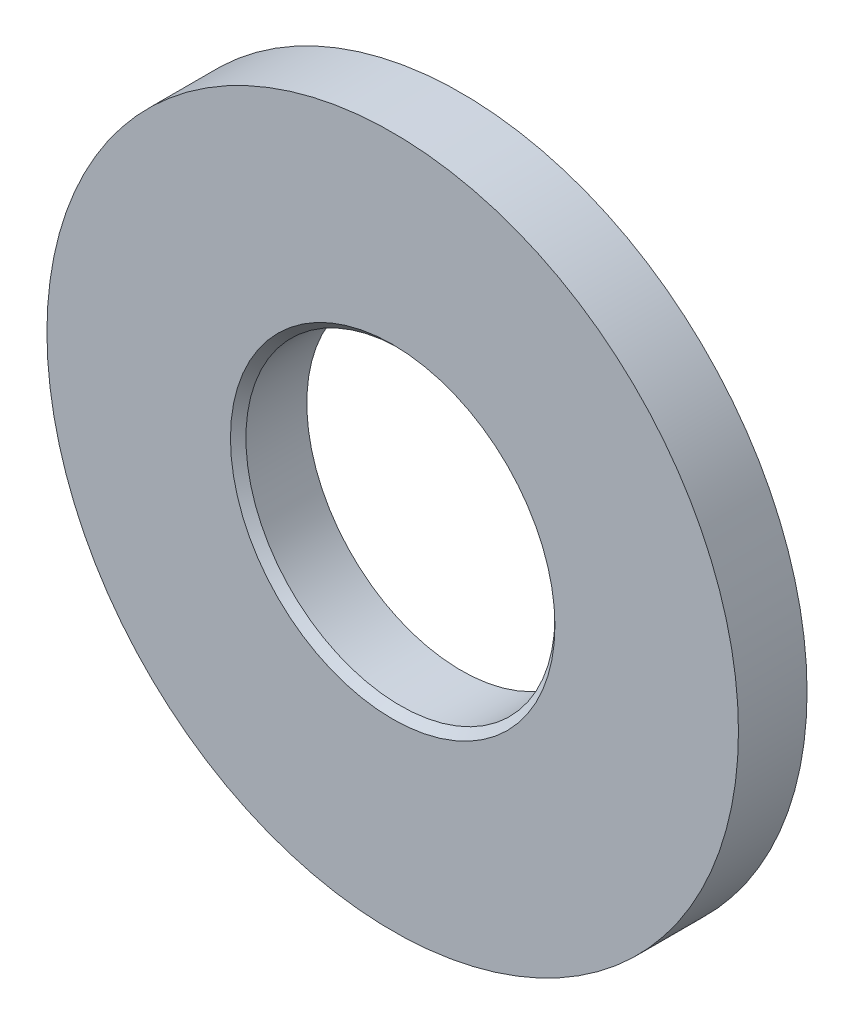
ISO-10303-21;
HEADER;
FILE_DESCRIPTION(('STEP AP214'),'2;1');
FILE_NAME('part.step','',(''),(''),'','','');
FILE_SCHEMA(('AUTOMOTIVE_DESIGN { 1 0 10303 214 1 1 1 1 }'));
ENDSEC;
DATA;
#1=APPLICATION_CONTEXT('core data for automotive mechanical design processes');
#2=APPLICATION_PROTOCOL_DEFINITION('international standard','automotive_design',2000,#1);
#3=PRODUCT_CONTEXT('',#1,'mechanical');
#4=PRODUCT('Part','Part','',(#3));
#5=PRODUCT_RELATED_PRODUCT_CATEGORY('part','',(#4));
#6=PRODUCT_DEFINITION_FORMATION('','',#4);
#7=PRODUCT_DEFINITION_CONTEXT('part definition',#1,'design');
#8=PRODUCT_DEFINITION('design','',#6,#7);
#9=PRODUCT_DEFINITION_SHAPE('','',#8);
#10=(LENGTH_UNIT() NAMED_UNIT(*) SI_UNIT(.MILLI.,.METRE.));
#11=(NAMED_UNIT(*) PLANE_ANGLE_UNIT() SI_UNIT($,.RADIAN.));
#12=(NAMED_UNIT(*) SI_UNIT($,.STERADIAN.) SOLID_ANGLE_UNIT());
#13=UNCERTAINTY_MEASURE_WITH_UNIT(LENGTH_MEASURE(1.E-05),#10,'distance_accuracy_value','');
#14=(GEOMETRIC_REPRESENTATION_CONTEXT(3) GLOBAL_UNCERTAINTY_ASSIGNED_CONTEXT((#13)) GLOBAL_UNIT_ASSIGNED_CONTEXT((#10,
#11,#12)) REPRESENTATION_CONTEXT('',''));
#15=CARTESIAN_POINT('',(0.,0.,0.));
#16=DIRECTION('',(0.,0.,1.));
#17=DIRECTION('',(1.,0.,0.));
#18=AXIS2_PLACEMENT_3D('',#15,#16,#17);
#19=CARTESIAN_POINT('',(0.,0.,0.80645));
#20=DIRECTION('',(0.,0.,1.));
#21=DIRECTION('',(1.,0.,0.));
#22=AXIS2_PLACEMENT_3D('',#19,#20,#21);
#23=PLANE('',#22);
#24=CARTESIAN_POINT('',(0.,0.,0.80645));
#25=DIRECTION('',(0.,0.,1.));
#26=DIRECTION('',(1.,0.,0.));
#27=AXIS2_PLACEMENT_3D('',#24,#25,#26);
#28=CIRCLE('',#27,3.81381);
#29=CARTESIAN_POINT('',(3.81381,0.,0.80645));
#30=VERTEX_POINT('',#29);
#31=EDGE_CURVE('E10',#30,#30,#28,.F.);
#32=ORIENTED_EDGE('',*,*,#31,.T.);
#33=EDGE_LOOP('',(#32));
#34=FACE_BOUND('',#33,.T.);
#35=CARTESIAN_POINT('',(0.,0.,0.80645));
#36=DIRECTION('',(0.,0.,1.));
#37=DIRECTION('',(1.,0.,0.));
#38=AXIS2_PLACEMENT_3D('',#35,#36,#37);
#39=CIRCLE('',#38,8.128);
#40=CARTESIAN_POINT('',(8.128,0.,0.80645));
#41=VERTEX_POINT('',#40);
#42=EDGE_CURVE('E43',#41,#41,#39,.T.);
#43=ORIENTED_EDGE('',*,*,#42,.T.);
#44=EDGE_LOOP('',(#43));
#45=FACE_BOUND('',#44,.T.);
#46=ADVANCED_FACE('F32',(#34,#45),#23,.T.);
#47=CARTESIAN_POINT('',(0.,0.,-0.80645));
#48=DIRECTION('',(0.,0.,1.));
#49=DIRECTION('',(1.,0.,0.));
#50=AXIS2_PLACEMENT_3D('',#47,#48,#49);
#51=PLANE('',#50);
#52=CARTESIAN_POINT('',(0.,0.,-0.80645));
#53=DIRECTION('',(0.,0.,1.));
#54=DIRECTION('',(1.,0.,0.));
#55=AXIS2_PLACEMENT_3D('',#52,#53,#54);
#56=CIRCLE('',#55,8.128);
#57=CARTESIAN_POINT('',(8.128,0.,-0.80645));
#58=VERTEX_POINT('',#57);
#59=EDGE_CURVE('E47',#58,#58,#56,.T.);
#60=ORIENTED_EDGE('',*,*,#59,.F.);
#61=EDGE_LOOP('',(#60));
#62=FACE_BOUND('',#61,.T.);
#63=CARTESIAN_POINT('',(0.,0.,-0.80645));
#64=DIRECTION('',(0.,0.,1.));
#65=DIRECTION('',(1.,0.,0.));
#66=AXIS2_PLACEMENT_3D('',#63,#64,#65);
#67=CIRCLE('',#66,3.6322);
#68=CARTESIAN_POINT('',(3.6322,0.,-0.80645));
#69=VERTEX_POINT('',#68);
#70=EDGE_CURVE('E51',#69,#69,#67,.T.);
#71=ORIENTED_EDGE('',*,*,#70,.T.);
#72=EDGE_LOOP('',(#71));
#73=FACE_BOUND('',#72,.T.);
#74=ADVANCED_FACE('F56',(#62,#73),#51,.F.);
#75=CARTESIAN_POINT('',(0.,0.,0.80645));
#76=DIRECTION('',(0.,0.,-1.));
#77=DIRECTION('',(-1.,0.,0.));
#78=AXIS2_PLACEMENT_3D('',#75,#76,#77);
#79=CYLINDRICAL_SURFACE('',#78,8.128);
#80=ORIENTED_EDGE('',*,*,#42,.F.);
#81=EDGE_LOOP('',(#80));
#82=FACE_BOUND('',#81,.T.);
#83=ORIENTED_EDGE('',*,*,#59,.T.);
#84=EDGE_LOOP('',(#83));
#85=FACE_BOUND('',#84,.T.);
#86=ADVANCED_FACE('F60',(#82,#85),#79,.T.);
#87=CARTESIAN_POINT('',(0.,0.,0.80645));
#88=DIRECTION('',(0.,0.,-1.));
#89=DIRECTION('',(-1.,0.,0.));
#90=AXIS2_PLACEMENT_3D('',#87,#88,#89);
#91=CYLINDRICAL_SURFACE('',#90,3.6322);
#92=CARTESIAN_POINT('',(0.,0.,0.624839999999999));
#93=DIRECTION('',(0.,0.,1.));
#94=DIRECTION('',(1.,0.,0.));
#95=AXIS2_PLACEMENT_3D('',#92,#93,#94);
#96=CIRCLE('',#95,3.6322);
#97=CARTESIAN_POINT('',(3.6322,0.,0.624839999999999));
#98=VERTEX_POINT('',#97);
#99=EDGE_CURVE('E39',#98,#98,#96,.T.);
#100=ORIENTED_EDGE('',*,*,#99,.T.);
#101=EDGE_LOOP('',(#100));
#102=FACE_BOUND('',#101,.T.);
#103=ORIENTED_EDGE('',*,*,#70,.F.);
#104=EDGE_LOOP('',(#103));
#105=FACE_BOUND('',#104,.T.);
#106=ADVANCED_FACE('F58',(#102,#105),#91,.F.);
#107=CARTESIAN_POINT('',(0.,0.,0.624839999999999));
#108=DIRECTION('',(0.,0.,1.));
#109=DIRECTION('',(1.,0.,0.));
#110=AXIS2_PLACEMENT_3D('',#107,#108,#109);
#111=CONICAL_SURFACE('',#110,3.6322,0.785398163397448);
#112=ORIENTED_EDGE('',*,*,#31,.F.);
#113=EDGE_LOOP('',(#112));
#114=FACE_BOUND('',#113,.T.);
#115=ORIENTED_EDGE('',*,*,#99,.F.);
#116=EDGE_LOOP('',(#115));
#117=FACE_BOUND('',#116,.T.);
#118=ADVANCED_FACE('F34',(#114,#117),#111,.F.);
#119=CLOSED_SHELL('',(#46,#74,#86,#106,#118));
#120=MANIFOLD_SOLID_BREP('B2',#119);
#121=ADVANCED_BREP_SHAPE_REPRESENTATION('',(#18,#120),#14);
#122=SHAPE_DEFINITION_REPRESENTATION(#9,#121);
ENDSEC;
END-ISO-10303-21;
